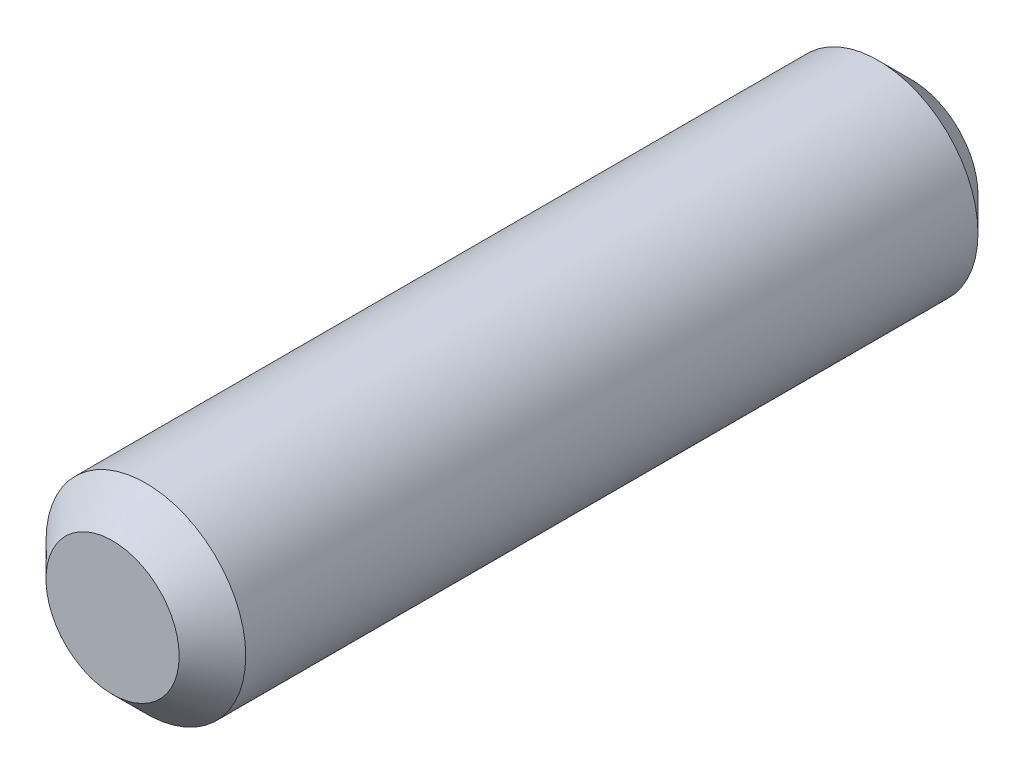
ISO-10303-21;
HEADER;
FILE_DESCRIPTION(('STEP AP214'),'2;1');
FILE_NAME('part.step','',(''),(''),'','','');
FILE_SCHEMA(('AUTOMOTIVE_DESIGN { 1 0 10303 214 1 1 1 1 }'));
ENDSEC;
DATA;
#1=APPLICATION_CONTEXT('core data for automotive mechanical design processes');
#2=APPLICATION_PROTOCOL_DEFINITION('international standard','automotive_design',2000,#1);
#3=PRODUCT_CONTEXT('',#1,'mechanical');
#4=PRODUCT('Part','Part','',(#3));
#5=PRODUCT_RELATED_PRODUCT_CATEGORY('part','',(#4));
#6=PRODUCT_DEFINITION_FORMATION('','',#4);
#7=PRODUCT_DEFINITION_CONTEXT('part definition',#1,'design');
#8=PRODUCT_DEFINITION('design','',#6,#7);
#9=PRODUCT_DEFINITION_SHAPE('','',#8);
#10=(LENGTH_UNIT() NAMED_UNIT(*) SI_UNIT(.MILLI.,.METRE.));
#11=(NAMED_UNIT(*) PLANE_ANGLE_UNIT() SI_UNIT($,.RADIAN.));
#12=(NAMED_UNIT(*) SI_UNIT($,.STERADIAN.) SOLID_ANGLE_UNIT());
#13=UNCERTAINTY_MEASURE_WITH_UNIT(LENGTH_MEASURE(1.E-05),#10,'distance_accuracy_value','');
#14=(GEOMETRIC_REPRESENTATION_CONTEXT(3) GLOBAL_UNCERTAINTY_ASSIGNED_CONTEXT((#13)) GLOBAL_UNIT_ASSIGNED_CONTEXT((#10,
#11,#12)) REPRESENTATION_CONTEXT('',''));
#15=CARTESIAN_POINT('',(0.,0.,0.));
#16=DIRECTION('',(0.,0.,1.));
#17=DIRECTION('',(1.,0.,0.));
#18=AXIS2_PLACEMENT_3D('',#15,#16,#17);
#19=CARTESIAN_POINT('',(0.,0.,12.));
#20=DIRECTION('',(0.,0.,-1.));
#21=DIRECTION('',(-1.,0.,0.));
#22=AXIS2_PLACEMENT_3D('',#19,#20,#21);
#23=CYLINDRICAL_SURFACE('',#22,1.5);
#24=CARTESIAN_POINT('',(0.,0.,0.5));
#25=DIRECTION('',(0.,0.,1.));
#26=DIRECTION('',(1.,0.,0.));
#27=AXIS2_PLACEMENT_3D('',#24,#25,#26);
#28=CIRCLE('',#27,1.5);
#29=CARTESIAN_POINT('',(1.5,0.,0.5));
#30=VERTEX_POINT('',#29);
#31=EDGE_CURVE('E60',#30,#30,#28,.T.);
#32=ORIENTED_EDGE('',*,*,#31,.T.);
#33=EDGE_LOOP('',(#32));
#34=FACE_BOUND('',#33,.T.);
#35=CARTESIAN_POINT('',(0.,0.,11.5));
#36=DIRECTION('',(0.,0.,1.));
#37=DIRECTION('',(1.,0.,0.));
#38=AXIS2_PLACEMENT_3D('',#35,#36,#37);
#39=CIRCLE('',#38,1.5);
#40=CARTESIAN_POINT('',(1.5,0.,11.5));
#41=VERTEX_POINT('',#40);
#42=EDGE_CURVE('E65',#41,#41,#39,.F.);
#43=ORIENTED_EDGE('',*,*,#42,.T.);
#44=EDGE_LOOP('',(#43));
#45=FACE_BOUND('',#44,.T.);
#46=ADVANCED_FACE('F46',(#34,#45),#23,.T.);
#47=CARTESIAN_POINT('',(0.,0.,12.));
#48=DIRECTION('',(0.,0.,1.));
#49=DIRECTION('',(1.,0.,0.));
#50=AXIS2_PLACEMENT_3D('',#47,#48,#49);
#51=PLANE('',#50);
#52=CARTESIAN_POINT('',(0.,0.,12.));
#53=DIRECTION('',(0.,0.,1.));
#54=DIRECTION('',(1.,0.,0.));
#55=AXIS2_PLACEMENT_3D('',#52,#53,#54);
#56=CIRCLE('',#55,1.);
#57=CARTESIAN_POINT('',(1.,0.,12.));
#58=VERTEX_POINT('',#57);
#59=EDGE_CURVE('E10',#58,#58,#56,.T.);
#60=ORIENTED_EDGE('',*,*,#59,.T.);
#61=EDGE_LOOP('',(#60));
#62=FACE_BOUND('',#61,.T.);
#63=ADVANCED_FACE('F82',(#62),#51,.T.);
#64=CARTESIAN_POINT('',(0.,0.,0.));
#65=DIRECTION('',(0.,0.,1.));
#66=DIRECTION('',(1.,0.,0.));
#67=AXIS2_PLACEMENT_3D('',#64,#65,#66);
#68=PLANE('',#67);
#69=CARTESIAN_POINT('',(0.,0.,0.));
#70=DIRECTION('',(0.,0.,1.));
#71=DIRECTION('',(1.,0.,0.));
#72=AXIS2_PLACEMENT_3D('',#69,#70,#71);
#73=CIRCLE('',#72,0.999999999999998);
#74=CARTESIAN_POINT('',(0.999999999999998,0.,0.));
#75=VERTEX_POINT('',#74);
#76=EDGE_CURVE('E55',#75,#75,#73,.F.);
#77=ORIENTED_EDGE('',*,*,#76,.T.);
#78=EDGE_LOOP('',(#77));
#79=FACE_BOUND('',#78,.T.);
#80=ADVANCED_FACE('F79',(#79),#68,.F.);
#81=CARTESIAN_POINT('',(0.,0.,0.5));
#82=DIRECTION('',(0.,0.,1.));
#83=DIRECTION('',(1.,0.,0.));
#84=AXIS2_PLACEMENT_3D('',#81,#82,#83);
#85=CONICAL_SURFACE('',#84,1.5,0.78539816339745);
#86=ORIENTED_EDGE('',*,*,#76,.F.);
#87=EDGE_LOOP('',(#86));
#88=FACE_BOUND('',#87,.T.);
#89=ORIENTED_EDGE('',*,*,#31,.F.);
#90=EDGE_LOOP('',(#89));
#91=FACE_BOUND('',#90,.T.);
#92=ADVANCED_FACE('F75',(#88,#91),#85,.T.);
#93=CARTESIAN_POINT('',(0.,0.,12.));
#94=DIRECTION('',(0.,0.,-1.));
#95=DIRECTION('',(-1.,0.,0.));
#96=AXIS2_PLACEMENT_3D('',#93,#94,#95);
#97=CONICAL_SURFACE('',#96,1.,0.785398163397447);
#98=ORIENTED_EDGE('',*,*,#42,.F.);
#99=EDGE_LOOP('',(#98));
#100=FACE_BOUND('',#99,.T.);
#101=ORIENTED_EDGE('',*,*,#59,.F.);
#102=EDGE_LOOP('',(#101));
#103=FACE_BOUND('',#102,.T.);
#104=ADVANCED_FACE('F49',(#100,#103),#97,.T.);
#105=CLOSED_SHELL('',(#46,#63,#80,#92,#104));
#106=MANIFOLD_SOLID_BREP('B2',#105);
#107=ADVANCED_BREP_SHAPE_REPRESENTATION('',(#18,#106),#14);
#108=SHAPE_DEFINITION_REPRESENTATION(#9,#107);
ENDSEC;
END-ISO-10303-21;
